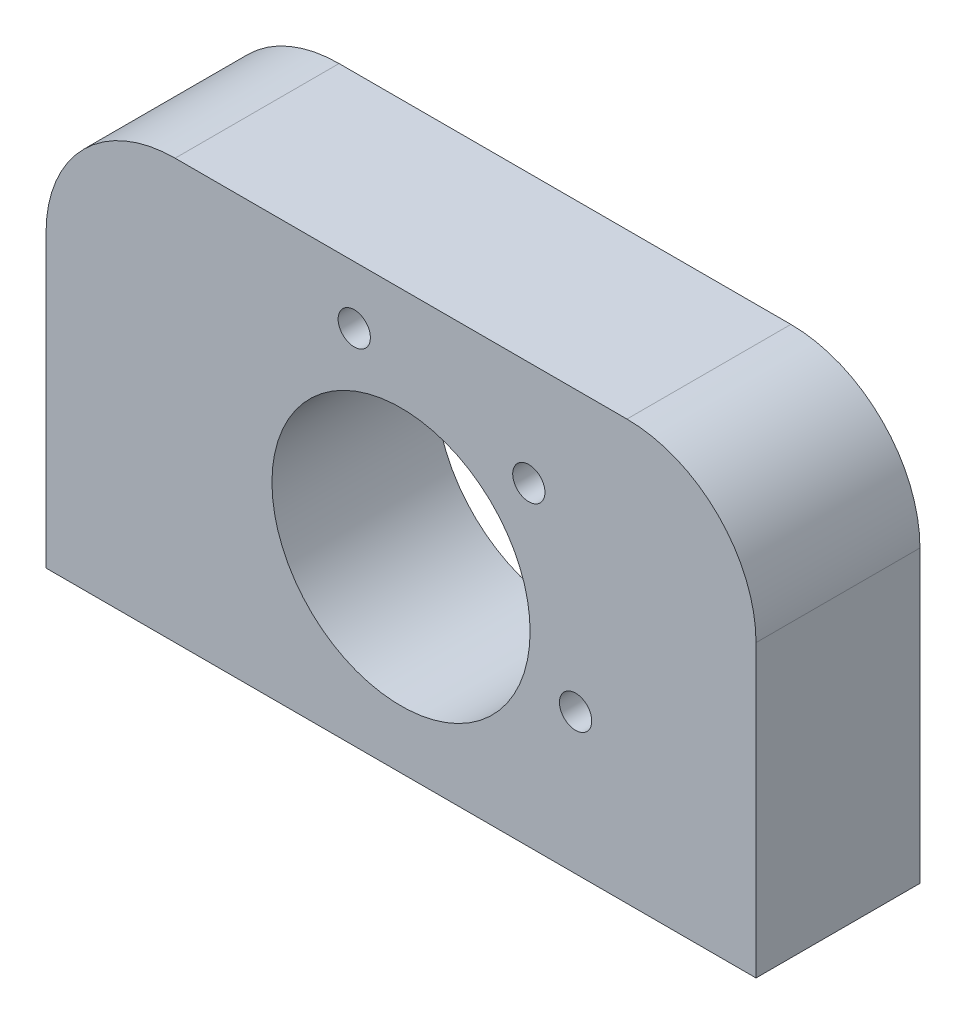
ISO-10303-21;
HEADER;
FILE_DESCRIPTION(('STEP AP214'),'2;1');
FILE_NAME('part.step','',(''),(''),'','','');
FILE_SCHEMA(('AUTOMOTIVE_DESIGN { 1 0 10303 214 1 1 1 1 }'));
ENDSEC;
DATA;
#1=APPLICATION_CONTEXT('core data for automotive mechanical design processes');
#2=APPLICATION_PROTOCOL_DEFINITION('international standard','automotive_design',2000,#1);
#3=PRODUCT_CONTEXT('',#1,'mechanical');
#4=PRODUCT('Part','Part','',(#3));
#5=PRODUCT_RELATED_PRODUCT_CATEGORY('part','',(#4));
#6=PRODUCT_DEFINITION_FORMATION('','',#4);
#7=PRODUCT_DEFINITION_CONTEXT('part definition',#1,'design');
#8=PRODUCT_DEFINITION('design','',#6,#7);
#9=PRODUCT_DEFINITION_SHAPE('','',#8);
#10=(LENGTH_UNIT() NAMED_UNIT(*) SI_UNIT(.MILLI.,.METRE.));
#11=(NAMED_UNIT(*) PLANE_ANGLE_UNIT() SI_UNIT($,.RADIAN.));
#12=(NAMED_UNIT(*) SI_UNIT($,.STERADIAN.) SOLID_ANGLE_UNIT());
#13=UNCERTAINTY_MEASURE_WITH_UNIT(LENGTH_MEASURE(1.E-05),#10,'distance_accuracy_value','');
#14=(GEOMETRIC_REPRESENTATION_CONTEXT(3) GLOBAL_UNCERTAINTY_ASSIGNED_CONTEXT((#13)) GLOBAL_UNIT_ASSIGNED_CONTEXT((#10,
#11,#12)) REPRESENTATION_CONTEXT('',''));
#15=CARTESIAN_POINT('',(0.,0.,0.));
#16=DIRECTION('',(0.,0.,1.));
#17=DIRECTION('',(1.,0.,0.));
#18=AXIS2_PLACEMENT_3D('',#15,#16,#17);
#19=CARTESIAN_POINT('',(-17.5,22.5,12.7));
#20=DIRECTION('',(0.,0.,-1.));
#21=DIRECTION('',(-1.,0.,0.));
#22=AXIS2_PLACEMENT_3D('',#19,#20,#21);
#23=PLANE('',#22);
#24=CARTESIAN_POINT('',(13.5229615680469,10.8765333685647,12.7));
#25=DIRECTION('',(0.,0.,-1.));
#26=DIRECTION('',(-1.,0.,0.));
#27=AXIS2_PLACEMENT_3D('',#24,#25,#26);
#28=CIRCLE('',#27,1.25);
#29=CARTESIAN_POINT('',(12.2729615680469,10.8765333685647,12.7));
#30=VERTEX_POINT('',#29);
#31=EDGE_CURVE('E224',#30,#30,#28,.T.);
#32=ORIENTED_EDGE('',*,*,#31,.T.);
#33=EDGE_LOOP('',(#32));
#34=FACE_BOUND('',#33,.T.);
#35=CARTESIAN_POINT('',(9.89949493661168,24.3994949366116,12.7));
#36=DIRECTION('',(0.,0.,-1.));
#37=DIRECTION('',(-1.,0.,0.));
#38=AXIS2_PLACEMENT_3D('',#35,#36,#37);
#39=CIRCLE('',#38,1.25);
#40=CARTESIAN_POINT('',(8.64949493661169,24.3994949366116,12.7));
#41=VERTEX_POINT('',#40);
#42=EDGE_CURVE('E229',#41,#41,#39,.T.);
#43=ORIENTED_EDGE('',*,*,#42,.T.);
#44=EDGE_LOOP('',(#43));
#45=FACE_BOUND('',#44,.T.);
#46=CARTESIAN_POINT('',(-3.6234666314353,28.022961568047,12.7));
#47=DIRECTION('',(0.,0.,-1.));
#48=DIRECTION('',(-1.,0.,0.));
#49=AXIS2_PLACEMENT_3D('',#46,#47,#48);
#50=CIRCLE('',#49,1.25);
#51=CARTESIAN_POINT('',(-4.8734666314353,28.022961568047,12.7));
#52=VERTEX_POINT('',#51);
#53=EDGE_CURVE('E235',#52,#52,#50,.T.);
#54=ORIENTED_EDGE('',*,*,#53,.T.);
#55=EDGE_LOOP('',(#54));
#56=FACE_BOUND('',#55,.T.);
#57=DIRECTION('',(0.,-1.,0.));
#58=VECTOR('',#57,1.);
#59=CARTESIAN_POINT('',(-27.5,0.,12.7));
#60=LINE('',#59,#58);
#61=CARTESIAN_POINT('',(-27.5,22.5,12.7));
#62=VERTEX_POINT('',#61);
#63=CARTESIAN_POINT('',(-27.5,0.,12.7));
#64=VERTEX_POINT('',#63);
#65=EDGE_CURVE('E139',#62,#64,#60,.T.);
#66=ORIENTED_EDGE('',*,*,#65,.T.);
#67=DIRECTION('',(1.,0.,0.));
#68=VECTOR('',#67,1.);
#69=CARTESIAN_POINT('',(27.5,0.,12.7));
#70=LINE('',#69,#68);
#71=CARTESIAN_POINT('',(27.5,0.,12.7));
#72=VERTEX_POINT('',#71);
#73=EDGE_CURVE('E95',#64,#72,#70,.T.);
#74=ORIENTED_EDGE('',*,*,#73,.T.);
#75=DIRECTION('',(0.,1.,0.));
#76=VECTOR('',#75,1.);
#77=CARTESIAN_POINT('',(27.5,0.,12.7));
#78=LINE('',#77,#76);
#79=CARTESIAN_POINT('',(27.5,22.5,12.7));
#80=VERTEX_POINT('',#79);
#81=EDGE_CURVE('E110',#72,#80,#78,.T.);
#82=ORIENTED_EDGE('',*,*,#81,.T.);
#83=CARTESIAN_POINT('',(17.5,22.5,12.7));
#84=DIRECTION('',(0.,0.,1.));
#85=DIRECTION('',(1.,0.,0.));
#86=AXIS2_PLACEMENT_3D('',#83,#84,#85);
#87=CIRCLE('',#86,10.);
#88=CARTESIAN_POINT('',(17.5,32.5,12.7));
#89=VERTEX_POINT('',#88);
#90=EDGE_CURVE('E104',#80,#89,#87,.T.);
#91=ORIENTED_EDGE('',*,*,#90,.T.);
#92=DIRECTION('',(-1.,0.,0.));
#93=VECTOR('',#92,1.);
#94=CARTESIAN_POINT('',(-17.5,32.5,12.7));
#95=LINE('',#94,#93);
#96=CARTESIAN_POINT('',(-17.5,32.5,12.7));
#97=VERTEX_POINT('',#96);
#98=EDGE_CURVE('E108',#89,#97,#95,.T.);
#99=ORIENTED_EDGE('',*,*,#98,.T.);
#100=CARTESIAN_POINT('',(-17.5,22.5,12.7));
#101=DIRECTION('',(0.,0.,1.));
#102=DIRECTION('',(-1.,0.,0.));
#103=AXIS2_PLACEMENT_3D('',#100,#101,#102);
#104=CIRCLE('',#103,10.);
#105=EDGE_CURVE('E57',#97,#62,#104,.T.);
#106=ORIENTED_EDGE('',*,*,#105,.T.);
#107=EDGE_LOOP('',(#66,#74,#82,#91,#99,#106));
#108=FACE_BOUND('',#107,.T.);
#109=CARTESIAN_POINT('',(0.,14.5,12.7));
#110=DIRECTION('',(0.,0.,1.));
#111=DIRECTION('',(1.,0.,0.));
#112=AXIS2_PLACEMENT_3D('',#109,#110,#111);
#113=CIRCLE('',#112,10.);
#114=CARTESIAN_POINT('',(10.,14.5,12.7));
#115=VERTEX_POINT('',#114);
#116=EDGE_CURVE('E132',#115,#115,#113,.T.);
#117=ORIENTED_EDGE('',*,*,#116,.F.);
#118=EDGE_LOOP('',(#117));
#119=FACE_BOUND('',#118,.T.);
#120=ADVANCED_FACE('F40',(#34,#45,#56,#108,#119),#23,.F.);
#121=CARTESIAN_POINT('',(-17.5,22.5,0.));
#122=DIRECTION('',(0.,0.,-1.));
#123=DIRECTION('',(-1.,0.,0.));
#124=AXIS2_PLACEMENT_3D('',#121,#122,#123);
#125=PLANE('',#124);
#126=CARTESIAN_POINT('',(13.5229615680469,10.8765333685647,0.));
#127=DIRECTION('',(0.,0.,-1.));
#128=DIRECTION('',(-1.,0.,0.));
#129=AXIS2_PLACEMENT_3D('',#126,#127,#128);
#130=CIRCLE('',#129,1.25);
#131=CARTESIAN_POINT('',(12.2729615680469,10.8765333685647,0.));
#132=VERTEX_POINT('',#131);
#133=EDGE_CURVE('E221',#132,#132,#130,.T.);
#134=ORIENTED_EDGE('',*,*,#133,.F.);
#135=EDGE_LOOP('',(#134));
#136=FACE_BOUND('',#135,.T.);
#137=CARTESIAN_POINT('',(9.89949493661168,24.3994949366116,0.));
#138=DIRECTION('',(0.,0.,-1.));
#139=DIRECTION('',(-1.,0.,0.));
#140=AXIS2_PLACEMENT_3D('',#137,#138,#139);
#141=CIRCLE('',#140,1.25);
#142=CARTESIAN_POINT('',(8.64949493661169,24.3994949366116,0.));
#143=VERTEX_POINT('',#142);
#144=EDGE_CURVE('E226',#143,#143,#141,.T.);
#145=ORIENTED_EDGE('',*,*,#144,.F.);
#146=EDGE_LOOP('',(#145));
#147=FACE_BOUND('',#146,.T.);
#148=CARTESIAN_POINT('',(-3.6234666314353,28.022961568047,0.));
#149=DIRECTION('',(0.,0.,-1.));
#150=DIRECTION('',(-1.,0.,0.));
#151=AXIS2_PLACEMENT_3D('',#148,#149,#150);
#152=CIRCLE('',#151,1.25);
#153=CARTESIAN_POINT('',(-4.8734666314353,28.022961568047,0.));
#154=VERTEX_POINT('',#153);
#155=EDGE_CURVE('E232',#154,#154,#152,.T.);
#156=ORIENTED_EDGE('',*,*,#155,.F.);
#157=EDGE_LOOP('',(#156));
#158=FACE_BOUND('',#157,.T.);
#159=DIRECTION('',(0.,-1.,0.));
#160=VECTOR('',#159,1.);
#161=CARTESIAN_POINT('',(-27.5,0.,0.));
#162=LINE('',#161,#160);
#163=CARTESIAN_POINT('',(-27.5,22.5,0.));
#164=VERTEX_POINT('',#163);
#165=CARTESIAN_POINT('',(-27.5,0.,0.));
#166=VERTEX_POINT('',#165);
#167=EDGE_CURVE('E128',#164,#166,#162,.T.);
#168=ORIENTED_EDGE('',*,*,#167,.F.);
#169=CARTESIAN_POINT('',(-17.5,22.5,0.));
#170=DIRECTION('',(0.,0.,1.));
#171=DIRECTION('',(-1.,0.,0.));
#172=AXIS2_PLACEMENT_3D('',#169,#170,#171);
#173=CIRCLE('',#172,10.);
#174=CARTESIAN_POINT('',(-17.5,32.5,0.));
#175=VERTEX_POINT('',#174);
#176=EDGE_CURVE('E87',#175,#164,#173,.T.);
#177=ORIENTED_EDGE('',*,*,#176,.F.);
#178=DIRECTION('',(-1.,0.,0.));
#179=VECTOR('',#178,1.);
#180=CARTESIAN_POINT('',(-17.5,32.5,0.));
#181=LINE('',#180,#179);
#182=CARTESIAN_POINT('',(17.5,32.5,0.));
#183=VERTEX_POINT('',#182);
#184=EDGE_CURVE('E81',#183,#175,#181,.T.);
#185=ORIENTED_EDGE('',*,*,#184,.F.);
#186=CARTESIAN_POINT('',(17.5,22.5,0.));
#187=DIRECTION('',(0.,0.,1.));
#188=DIRECTION('',(1.,0.,0.));
#189=AXIS2_PLACEMENT_3D('',#186,#187,#188);
#190=CIRCLE('',#189,10.);
#191=CARTESIAN_POINT('',(27.5,22.5,0.));
#192=VERTEX_POINT('',#191);
#193=EDGE_CURVE('E118',#192,#183,#190,.T.);
#194=ORIENTED_EDGE('',*,*,#193,.F.);
#195=DIRECTION('',(0.,1.,0.));
#196=VECTOR('',#195,1.);
#197=CARTESIAN_POINT('',(27.5,0.,0.));
#198=LINE('',#197,#196);
#199=CARTESIAN_POINT('',(27.5,0.,0.));
#200=VERTEX_POINT('',#199);
#201=EDGE_CURVE('E134',#200,#192,#198,.T.);
#202=ORIENTED_EDGE('',*,*,#201,.F.);
#203=DIRECTION('',(1.,0.,0.));
#204=VECTOR('',#203,1.);
#205=CARTESIAN_POINT('',(27.5,0.,0.));
#206=LINE('',#205,#204);
#207=EDGE_CURVE('E131',#166,#200,#206,.T.);
#208=ORIENTED_EDGE('',*,*,#207,.F.);
#209=EDGE_LOOP('',(#168,#177,#185,#194,#202,#208));
#210=FACE_BOUND('',#209,.T.);
#211=CARTESIAN_POINT('',(0.,14.5,0.));
#212=DIRECTION('',(0.,0.,1.));
#213=DIRECTION('',(1.,0.,0.));
#214=AXIS2_PLACEMENT_3D('',#211,#212,#213);
#215=CIRCLE('',#214,10.);
#216=CARTESIAN_POINT('',(10.,14.5,0.));
#217=VERTEX_POINT('',#216);
#218=EDGE_CURVE('E238',#217,#217,#215,.T.);
#219=ORIENTED_EDGE('',*,*,#218,.T.);
#220=EDGE_LOOP('',(#219));
#221=FACE_BOUND('',#220,.T.);
#222=ADVANCED_FACE('F148',(#136,#147,#158,#210,#221),#125,.T.);
#223=CARTESIAN_POINT('',(-27.5,0.,12.7));
#224=DIRECTION('',(1.,0.,0.));
#225=DIRECTION('',(0.,1.,0.));
#226=AXIS2_PLACEMENT_3D('',#223,#224,#225);
#227=PLANE('',#226);
#228=ORIENTED_EDGE('',*,*,#167,.T.);
#229=DIRECTION('',(0.,0.,-1.));
#230=VECTOR('',#229,1.);
#231=CARTESIAN_POINT('',(-27.5,0.,12.7));
#232=LINE('',#231,#230);
#233=EDGE_CURVE('E11',#64,#166,#232,.T.);
#234=ORIENTED_EDGE('',*,*,#233,.F.);
#235=ORIENTED_EDGE('',*,*,#65,.F.);
#236=DIRECTION('',(0.,0.,-1.));
#237=VECTOR('',#236,1.);
#238=CARTESIAN_POINT('',(-27.5,22.5,12.7));
#239=LINE('',#238,#237);
#240=EDGE_CURVE('E124',#62,#164,#239,.T.);
#241=ORIENTED_EDGE('',*,*,#240,.T.);
#242=EDGE_LOOP('',(#228,#234,#235,#241));
#243=FACE_BOUND('',#242,.T.);
#244=ADVANCED_FACE('F42',(#243),#227,.F.);
#245=CARTESIAN_POINT('',(27.5,0.,12.7));
#246=DIRECTION('',(0.,1.,0.));
#247=DIRECTION('',(0.,0.,1.));
#248=AXIS2_PLACEMENT_3D('',#245,#246,#247);
#249=PLANE('',#248);
#250=CARTESIAN_POINT('',(22.25,0.,6.35));
#251=DIRECTION('',(0.,-1.,0.));
#252=DIRECTION('',(0.,0.,-1.));
#253=AXIS2_PLACEMENT_3D('',#250,#251,#252);
#254=CIRCLE('',#253,1.64999999999999);
#255=CARTESIAN_POINT('',(22.25,0.,4.70000000000001));
#256=VERTEX_POINT('',#255);
#257=EDGE_CURVE('E210',#256,#256,#254,.T.);
#258=ORIENTED_EDGE('',*,*,#257,.F.);
#259=EDGE_LOOP('',(#258));
#260=FACE_BOUND('',#259,.T.);
#261=CARTESIAN_POINT('',(-22.25,0.,6.34999999999999));
#262=DIRECTION('',(0.,-1.,0.));
#263=DIRECTION('',(0.,0.,-1.));
#264=AXIS2_PLACEMENT_3D('',#261,#262,#263);
#265=CIRCLE('',#264,1.64999999999999);
#266=CARTESIAN_POINT('',(-22.25,0.,4.7));
#267=VERTEX_POINT('',#266);
#268=EDGE_CURVE('E213',#267,#267,#265,.T.);
#269=ORIENTED_EDGE('',*,*,#268,.F.);
#270=EDGE_LOOP('',(#269));
#271=FACE_BOUND('',#270,.T.);
#272=ORIENTED_EDGE('',*,*,#207,.T.);
#273=DIRECTION('',(0.,0.,-1.));
#274=VECTOR('',#273,1.);
#275=CARTESIAN_POINT('',(27.5,0.,12.7));
#276=LINE('',#275,#274);
#277=EDGE_CURVE('E49',#72,#200,#276,.T.);
#278=ORIENTED_EDGE('',*,*,#277,.F.);
#279=ORIENTED_EDGE('',*,*,#73,.F.);
#280=ORIENTED_EDGE('',*,*,#233,.T.);
#281=EDGE_LOOP('',(#272,#278,#279,#280));
#282=FACE_BOUND('',#281,.T.);
#283=ADVANCED_FACE('F264',(#260,#271,#282),#249,.F.);
#284=CARTESIAN_POINT('',(27.5,0.,12.7));
#285=DIRECTION('',(-1.,0.,0.));
#286=DIRECTION('',(0.,-1.,0.));
#287=AXIS2_PLACEMENT_3D('',#284,#285,#286);
#288=PLANE('',#287);
#289=ORIENTED_EDGE('',*,*,#201,.T.);
#290=DIRECTION('',(0.,0.,-1.));
#291=VECTOR('',#290,1.);
#292=CARTESIAN_POINT('',(27.5,22.5,12.7));
#293=LINE('',#292,#291);
#294=EDGE_CURVE('E119',#80,#192,#293,.T.);
#295=ORIENTED_EDGE('',*,*,#294,.F.);
#296=ORIENTED_EDGE('',*,*,#81,.F.);
#297=ORIENTED_EDGE('',*,*,#277,.T.);
#298=EDGE_LOOP('',(#289,#295,#296,#297));
#299=FACE_BOUND('',#298,.T.);
#300=ADVANCED_FACE('F145',(#299),#288,.F.);
#301=CARTESIAN_POINT('',(17.5,22.5,12.7));
#302=DIRECTION('',(0.,0.,-1.));
#303=DIRECTION('',(-1.,0.,0.));
#304=AXIS2_PLACEMENT_3D('',#301,#302,#303);
#305=CYLINDRICAL_SURFACE('',#304,10.);
#306=ORIENTED_EDGE('',*,*,#193,.T.);
#307=DIRECTION('',(0.,0.,-1.));
#308=VECTOR('',#307,1.);
#309=CARTESIAN_POINT('',(17.5,32.5,12.7));
#310=LINE('',#309,#308);
#311=EDGE_CURVE('E115',#89,#183,#310,.T.);
#312=ORIENTED_EDGE('',*,*,#311,.F.);
#313=ORIENTED_EDGE('',*,*,#90,.F.);
#314=ORIENTED_EDGE('',*,*,#294,.T.);
#315=EDGE_LOOP('',(#306,#312,#313,#314));
#316=FACE_BOUND('',#315,.T.);
#317=ADVANCED_FACE('F116',(#316),#305,.T.);
#318=CARTESIAN_POINT('',(-17.5,32.5,12.7));
#319=DIRECTION('',(0.,-1.,0.));
#320=DIRECTION('',(0.,0.,-1.));
#321=AXIS2_PLACEMENT_3D('',#318,#319,#320);
#322=PLANE('',#321);
#323=ORIENTED_EDGE('',*,*,#184,.T.);
#324=DIRECTION('',(0.,0.,-1.));
#325=VECTOR('',#324,1.);
#326=CARTESIAN_POINT('',(-17.5,32.5,12.7));
#327=LINE('',#326,#325);
#328=EDGE_CURVE('E120',#97,#175,#327,.T.);
#329=ORIENTED_EDGE('',*,*,#328,.F.);
#330=ORIENTED_EDGE('',*,*,#98,.F.);
#331=ORIENTED_EDGE('',*,*,#311,.T.);
#332=EDGE_LOOP('',(#323,#329,#330,#331));
#333=FACE_BOUND('',#332,.T.);
#334=ADVANCED_FACE('F122',(#333),#322,.F.);
#335=CARTESIAN_POINT('',(-17.5,22.5,12.7));
#336=DIRECTION('',(0.,0.,-1.));
#337=DIRECTION('',(-1.,0.,0.));
#338=AXIS2_PLACEMENT_3D('',#335,#336,#337);
#339=CYLINDRICAL_SURFACE('',#338,10.);
#340=ORIENTED_EDGE('',*,*,#176,.T.);
#341=ORIENTED_EDGE('',*,*,#240,.F.);
#342=ORIENTED_EDGE('',*,*,#105,.F.);
#343=ORIENTED_EDGE('',*,*,#328,.T.);
#344=EDGE_LOOP('',(#340,#341,#342,#343));
#345=FACE_BOUND('',#344,.T.);
#346=ADVANCED_FACE('F153',(#345),#339,.T.);
#347=CARTESIAN_POINT('',(0.,14.5,12.7));
#348=DIRECTION('',(0.,0.,-1.));
#349=DIRECTION('',(-1.,0.,0.));
#350=AXIS2_PLACEMENT_3D('',#347,#348,#349);
#351=CYLINDRICAL_SURFACE('',#350,10.);
#352=ORIENTED_EDGE('',*,*,#116,.T.);
#353=EDGE_LOOP('',(#352));
#354=FACE_BOUND('',#353,.T.);
#355=ORIENTED_EDGE('',*,*,#218,.F.);
#356=EDGE_LOOP('',(#355));
#357=FACE_BOUND('',#356,.T.);
#358=ADVANCED_FACE('F155',(#354,#357),#351,.F.);
#359=CARTESIAN_POINT('',(-3.6234666314353,28.022961568047,0.));
#360=DIRECTION('',(0.,0.,-1.));
#361=DIRECTION('',(-1.,0.,0.));
#362=AXIS2_PLACEMENT_3D('',#359,#360,#361);
#363=CYLINDRICAL_SURFACE('',#362,1.25);
#364=ORIENTED_EDGE('',*,*,#155,.T.);
#365=EDGE_LOOP('',(#364));
#366=FACE_BOUND('',#365,.T.);
#367=ORIENTED_EDGE('',*,*,#53,.F.);
#368=EDGE_LOOP('',(#367));
#369=FACE_BOUND('',#368,.T.);
#370=ADVANCED_FACE('F161',(#366,#369),#363,.F.);
#371=CARTESIAN_POINT('',(9.89949493661168,24.3994949366116,0.));
#372=DIRECTION('',(0.,0.,-1.));
#373=DIRECTION('',(-1.,0.,0.));
#374=AXIS2_PLACEMENT_3D('',#371,#372,#373);
#375=CYLINDRICAL_SURFACE('',#374,1.25);
#376=ORIENTED_EDGE('',*,*,#144,.T.);
#377=EDGE_LOOP('',(#376));
#378=FACE_BOUND('',#377,.T.);
#379=ORIENTED_EDGE('',*,*,#42,.F.);
#380=EDGE_LOOP('',(#379));
#381=FACE_BOUND('',#380,.T.);
#382=ADVANCED_FACE('F178',(#378,#381),#375,.F.);
#383=CARTESIAN_POINT('',(13.5229615680469,10.8765333685647,0.));
#384=DIRECTION('',(0.,0.,-1.));
#385=DIRECTION('',(-1.,0.,0.));
#386=AXIS2_PLACEMENT_3D('',#383,#384,#385);
#387=CYLINDRICAL_SURFACE('',#386,1.25);
#388=ORIENTED_EDGE('',*,*,#133,.T.);
#389=EDGE_LOOP('',(#388));
#390=FACE_BOUND('',#389,.T.);
#391=ORIENTED_EDGE('',*,*,#31,.F.);
#392=EDGE_LOOP('',(#391));
#393=FACE_BOUND('',#392,.T.);
#394=ADVANCED_FACE('F182',(#390,#393),#387,.F.);
#395=CARTESIAN_POINT('',(-22.25,14.,6.34999999999999));
#396=DIRECTION('',(0.,-1.,0.));
#397=DIRECTION('',(0.,0.,-1.));
#398=AXIS2_PLACEMENT_3D('',#395,#396,#397);
#399=CONICAL_SURFACE('',#398,1.64999999999999,1.02974425867665);
#400=CARTESIAN_POINT('',(-22.25,14.9914200213955,6.34999999999999));
#401=VERTEX_POINT('',#400);
#402=VERTEX_LOOP('',#401);
#403=FACE_BOUND('',#402,.T.);
#404=CARTESIAN_POINT('',(-22.25,14.,6.34999999999999));
#405=DIRECTION('',(0.,-1.,0.));
#406=DIRECTION('',(0.,0.,-1.));
#407=AXIS2_PLACEMENT_3D('',#404,#405,#406);
#408=CIRCLE('',#407,1.64999999999999);
#409=CARTESIAN_POINT('',(-22.25,14.,4.70000000000001));
#410=VERTEX_POINT('',#409);
#411=EDGE_CURVE('E218',#410,#410,#408,.T.);
#412=ORIENTED_EDGE('',*,*,#411,.T.);
#413=EDGE_LOOP('',(#412));
#414=FACE_BOUND('',#413,.T.);
#415=ADVANCED_FACE('F186',(#403,#414),#399,.F.);
#416=CARTESIAN_POINT('',(-22.25,0.,6.34999999999999));
#417=DIRECTION('',(0.,-1.,0.));
#418=DIRECTION('',(0.,0.,-1.));
#419=AXIS2_PLACEMENT_3D('',#416,#417,#418);
#420=CYLINDRICAL_SURFACE('',#419,1.64999999999999);
#421=ORIENTED_EDGE('',*,*,#411,.F.);
#422=EDGE_LOOP('',(#421));
#423=FACE_BOUND('',#422,.T.);
#424=ORIENTED_EDGE('',*,*,#268,.T.);
#425=EDGE_LOOP('',(#424));
#426=FACE_BOUND('',#425,.T.);
#427=ADVANCED_FACE('F190',(#423,#426),#420,.F.);
#428=CARTESIAN_POINT('',(22.25,14.,6.35));
#429=DIRECTION('',(0.,-1.,0.));
#430=DIRECTION('',(0.,0.,-1.));
#431=AXIS2_PLACEMENT_3D('',#428,#429,#430);
#432=CONICAL_SURFACE('',#431,1.64999999999999,1.02974425867665);
#433=CARTESIAN_POINT('',(22.25,14.9914200213955,6.35));
#434=VERTEX_POINT('',#433);
#435=VERTEX_LOOP('',#434);
#436=FACE_BOUND('',#435,.T.);
#437=CARTESIAN_POINT('',(22.25,14.,6.35));
#438=DIRECTION('',(0.,-1.,0.));
#439=DIRECTION('',(0.,0.,-1.));
#440=AXIS2_PLACEMENT_3D('',#437,#438,#439);
#441=CIRCLE('',#440,1.64999999999999);
#442=CARTESIAN_POINT('',(22.25,14.,4.70000000000001));
#443=VERTEX_POINT('',#442);
#444=EDGE_CURVE('E207',#443,#443,#441,.T.);
#445=ORIENTED_EDGE('',*,*,#444,.T.);
#446=EDGE_LOOP('',(#445));
#447=FACE_BOUND('',#446,.T.);
#448=ADVANCED_FACE('F194',(#436,#447),#432,.F.);
#449=CARTESIAN_POINT('',(22.25,0.,6.35));
#450=DIRECTION('',(0.,-1.,0.));
#451=DIRECTION('',(0.,0.,-1.));
#452=AXIS2_PLACEMENT_3D('',#449,#450,#451);
#453=CYLINDRICAL_SURFACE('',#452,1.64999999999999);
#454=ORIENTED_EDGE('',*,*,#444,.F.);
#455=EDGE_LOOP('',(#454));
#456=FACE_BOUND('',#455,.T.);
#457=ORIENTED_EDGE('',*,*,#257,.T.);
#458=EDGE_LOOP('',(#457));
#459=FACE_BOUND('',#458,.T.);
#460=ADVANCED_FACE('F198',(#456,#459),#453,.F.);
#461=CLOSED_SHELL('',(#120,#222,#244,#283,#300,#317,#334,#346,#358,#370,#382,#394,#415,#427,
#448,#460));
#462=MANIFOLD_SOLID_BREP('B2',#461);
#463=ADVANCED_BREP_SHAPE_REPRESENTATION('',(#18,#462),#14);
#464=SHAPE_DEFINITION_REPRESENTATION(#9,#463);
ENDSEC;
END-ISO-10303-21;
